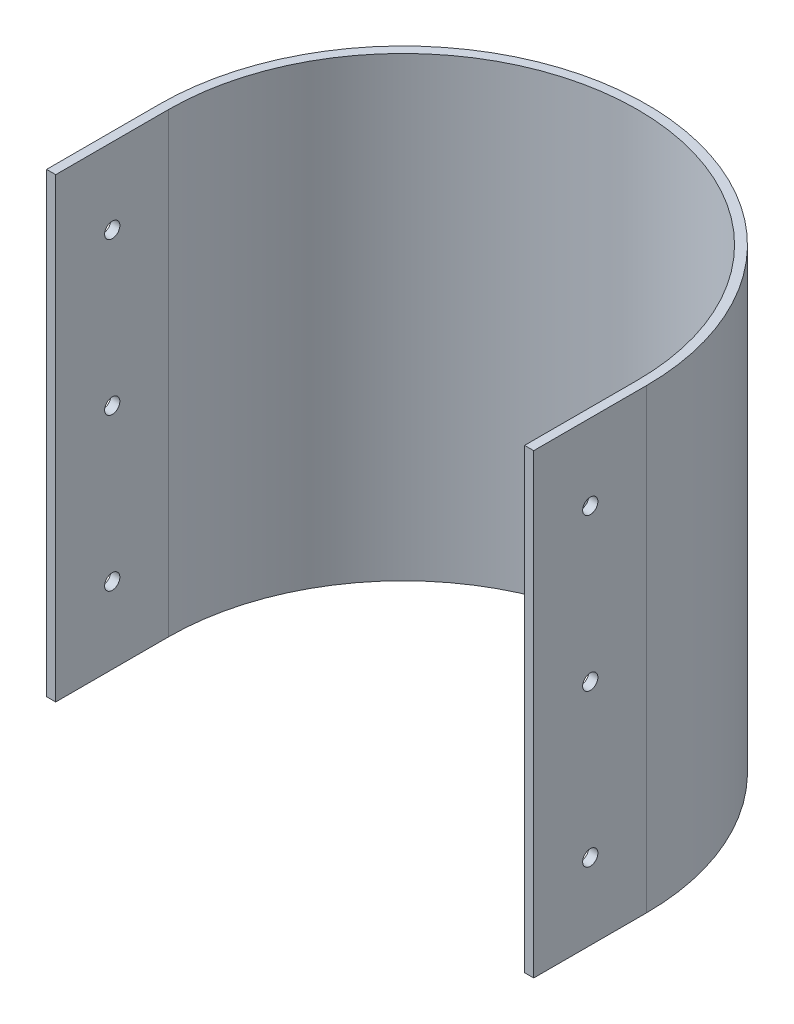
ISO-10303-21;
HEADER;
FILE_DESCRIPTION(('STEP AP214'),'2;1');
FILE_NAME('part.step','',(''),(''),'','','');
FILE_SCHEMA(('AUTOMOTIVE_DESIGN { 1 0 10303 214 1 1 1 1 }'));
ENDSEC;
DATA;
#1=APPLICATION_CONTEXT('core data for automotive mechanical design processes');
#2=APPLICATION_PROTOCOL_DEFINITION('international standard','automotive_design',2000,#1);
#3=PRODUCT_CONTEXT('',#1,'mechanical');
#4=PRODUCT('Part','Part','',(#3));
#5=PRODUCT_RELATED_PRODUCT_CATEGORY('part','',(#4));
#6=PRODUCT_DEFINITION_FORMATION('','',#4);
#7=PRODUCT_DEFINITION_CONTEXT('part definition',#1,'design');
#8=PRODUCT_DEFINITION('design','',#6,#7);
#9=PRODUCT_DEFINITION_SHAPE('','',#8);
#10=(LENGTH_UNIT() NAMED_UNIT(*) SI_UNIT(.MILLI.,.METRE.));
#11=(NAMED_UNIT(*) PLANE_ANGLE_UNIT() SI_UNIT($,.RADIAN.));
#12=(NAMED_UNIT(*) SI_UNIT($,.STERADIAN.) SOLID_ANGLE_UNIT());
#13=UNCERTAINTY_MEASURE_WITH_UNIT(LENGTH_MEASURE(1.E-05),#10,'distance_accuracy_value','');
#14=(GEOMETRIC_REPRESENTATION_CONTEXT(3) GLOBAL_UNCERTAINTY_ASSIGNED_CONTEXT((#13)) GLOBAL_UNIT_ASSIGNED_CONTEXT((#10,
#11,#12)) REPRESENTATION_CONTEXT('',''));
#15=CARTESIAN_POINT('',(0.,0.,0.));
#16=DIRECTION('',(0.,0.,1.));
#17=DIRECTION('',(1.,0.,0.));
#18=AXIS2_PLACEMENT_3D('',#15,#16,#17);
#19=CARTESIAN_POINT('',(-0.885057471264376,150.,0.));
#20=DIRECTION('',(0.,-1.,0.));
#21=DIRECTION('',(0.,0.,-1.));
#22=AXIS2_PLACEMENT_3D('',#19,#20,#21);
#23=CYLINDRICAL_SURFACE('',#22,77.);
#24=CARTESIAN_POINT('',(-0.885057471264376,0.,0.));
#25=DIRECTION('',(0.,-1.,0.));
#26=DIRECTION('',(0.,0.,-1.));
#27=AXIS2_PLACEMENT_3D('',#24,#25,#26);
#28=CIRCLE('',#27,77.);
#29=CARTESIAN_POINT('',(-77.8850574712644,0.,0.));
#30=VERTEX_POINT('',#29);
#31=CARTESIAN_POINT('',(76.1149425287356,0.,0.));
#32=VERTEX_POINT('',#31);
#33=EDGE_CURVE('E146',#30,#32,#28,.T.);
#34=ORIENTED_EDGE('',*,*,#33,.T.);
#35=DIRECTION('',(0.,-1.,0.));
#36=VECTOR('',#35,1.);
#37=CARTESIAN_POINT('',(76.1149425287356,150.,0.));
#38=LINE('',#37,#36);
#39=CARTESIAN_POINT('',(76.1149425287356,150.,0.));
#40=VERTEX_POINT('',#39);
#41=EDGE_CURVE('E11',#40,#32,#38,.T.);
#42=ORIENTED_EDGE('',*,*,#41,.F.);
#43=CARTESIAN_POINT('',(-0.885057471264376,150.,0.));
#44=DIRECTION('',(0.,-1.,0.));
#45=DIRECTION('',(0.,0.,-1.));
#46=AXIS2_PLACEMENT_3D('',#43,#44,#45);
#47=CIRCLE('',#46,77.);
#48=CARTESIAN_POINT('',(-77.8850574712644,150.,0.));
#49=VERTEX_POINT('',#48);
#50=EDGE_CURVE('E169',#49,#40,#47,.T.);
#51=ORIENTED_EDGE('',*,*,#50,.F.);
#52=DIRECTION('',(0.,-1.,0.));
#53=VECTOR('',#52,1.);
#54=CARTESIAN_POINT('',(-77.8850574712644,150.,0.));
#55=LINE('',#54,#53);
#56=EDGE_CURVE('E142',#49,#30,#55,.T.);
#57=ORIENTED_EDGE('',*,*,#56,.T.);
#58=EDGE_LOOP('',(#34,#42,#51,#57));
#59=FACE_BOUND('',#58,.T.);
#60=ADVANCED_FACE('F43',(#59),#23,.F.);
#61=CARTESIAN_POINT('',(76.1149425287356,150.,0.));
#62=DIRECTION('',(1.,0.,0.));
#63=DIRECTION('',(0.,0.,-1.));
#64=AXIS2_PLACEMENT_3D('',#61,#62,#63);
#65=PLANE('',#64);
#66=CARTESIAN_POINT('',(76.1149425287356,125.,18.5));
#67=DIRECTION('',(1.,0.,0.));
#68=DIRECTION('',(0.,0.,-1.));
#69=AXIS2_PLACEMENT_3D('',#66,#67,#68);
#70=CIRCLE('',#69,2.5);
#71=CARTESIAN_POINT('',(76.1149425287356,125.,16.));
#72=VERTEX_POINT('',#71);
#73=EDGE_CURVE('E151',#72,#72,#70,.T.);
#74=ORIENTED_EDGE('',*,*,#73,.T.);
#75=EDGE_LOOP('',(#74));
#76=FACE_BOUND('',#75,.T.);
#77=CARTESIAN_POINT('',(76.1149425287356,75.,18.5));
#78=DIRECTION('',(1.,0.,0.));
#79=DIRECTION('',(0.,0.,-1.));
#80=AXIS2_PLACEMENT_3D('',#77,#78,#79);
#81=CIRCLE('',#80,2.5);
#82=CARTESIAN_POINT('',(76.1149425287356,75.,16.));
#83=VERTEX_POINT('',#82);
#84=EDGE_CURVE('E195',#83,#83,#81,.T.);
#85=ORIENTED_EDGE('',*,*,#84,.T.);
#86=EDGE_LOOP('',(#85));
#87=FACE_BOUND('',#86,.T.);
#88=CARTESIAN_POINT('',(76.1149425287356,25.,18.5));
#89=DIRECTION('',(1.,0.,0.));
#90=DIRECTION('',(0.,0.,-1.));
#91=AXIS2_PLACEMENT_3D('',#88,#89,#90);
#92=CIRCLE('',#91,2.5);
#93=CARTESIAN_POINT('',(76.1149425287356,25.,16.));
#94=VERTEX_POINT('',#93);
#95=EDGE_CURVE('E190',#94,#94,#92,.T.);
#96=ORIENTED_EDGE('',*,*,#95,.T.);
#97=EDGE_LOOP('',(#96));
#98=FACE_BOUND('',#97,.T.);
#99=DIRECTION('',(0.,0.,1.));
#100=VECTOR('',#99,1.);
#101=CARTESIAN_POINT('',(76.1149425287356,0.,0.));
#102=LINE('',#101,#100);
#103=CARTESIAN_POINT('',(76.1149425287356,0.,37.0673767723387));
#104=VERTEX_POINT('',#103);
#105=EDGE_CURVE('E150',#32,#104,#102,.T.);
#106=ORIENTED_EDGE('',*,*,#105,.T.);
#107=DIRECTION('',(0.,-1.,0.));
#108=VECTOR('',#107,1.);
#109=CARTESIAN_POINT('',(76.1149425287356,150.,37.0673767723387));
#110=LINE('',#109,#108);
#111=CARTESIAN_POINT('',(76.1149425287356,150.,37.0673767723387));
#112=VERTEX_POINT('',#111);
#113=EDGE_CURVE('E53',#112,#104,#110,.T.);
#114=ORIENTED_EDGE('',*,*,#113,.F.);
#115=DIRECTION('',(0.,0.,1.));
#116=VECTOR('',#115,1.);
#117=CARTESIAN_POINT('',(76.1149425287356,150.,0.));
#118=LINE('',#117,#116);
#119=EDGE_CURVE('E105',#40,#112,#118,.T.);
#120=ORIENTED_EDGE('',*,*,#119,.F.);
#121=ORIENTED_EDGE('',*,*,#41,.T.);
#122=EDGE_LOOP('',(#106,#114,#120,#121));
#123=FACE_BOUND('',#122,.T.);
#124=ADVANCED_FACE('F250',(#76,#87,#98,#123),#65,.F.);
#125=CARTESIAN_POINT('',(76.1149425287356,150.,37.0673767723387));
#126=DIRECTION('',(0.,0.,-1.));
#127=DIRECTION('',(-1.,0.,0.));
#128=AXIS2_PLACEMENT_3D('',#125,#126,#127);
#129=PLANE('',#128);
#130=DIRECTION('',(1.,0.,0.));
#131=VECTOR('',#130,1.);
#132=CARTESIAN_POINT('',(76.1149425287356,0.,37.0673767723387));
#133=LINE('',#132,#131);
#134=CARTESIAN_POINT('',(79.1149425287356,0.,37.0673767723387));
#135=VERTEX_POINT('',#134);
#136=EDGE_CURVE('E154',#104,#135,#133,.T.);
#137=ORIENTED_EDGE('',*,*,#136,.T.);
#138=DIRECTION('',(0.,-1.,0.));
#139=VECTOR('',#138,1.);
#140=CARTESIAN_POINT('',(79.1149425287356,150.,37.0673767723387));
#141=LINE('',#140,#139);
#142=CARTESIAN_POINT('',(79.1149425287356,150.,37.0673767723387));
#143=VERTEX_POINT('',#142);
#144=EDGE_CURVE('E180',#143,#135,#141,.T.);
#145=ORIENTED_EDGE('',*,*,#144,.F.);
#146=DIRECTION('',(1.,0.,0.));
#147=VECTOR('',#146,1.);
#148=CARTESIAN_POINT('',(76.1149425287356,150.,37.0673767723387));
#149=LINE('',#148,#147);
#150=EDGE_CURVE('E217',#112,#143,#149,.T.);
#151=ORIENTED_EDGE('',*,*,#150,.F.);
#152=ORIENTED_EDGE('',*,*,#113,.T.);
#153=EDGE_LOOP('',(#137,#145,#151,#152));
#154=FACE_BOUND('',#153,.T.);
#155=ADVANCED_FACE('F255',(#154),#129,.F.);
#156=CARTESIAN_POINT('',(79.1149425287356,150.,37.0673767723387));
#157=DIRECTION('',(-1.,0.,0.));
#158=DIRECTION('',(0.,0.,1.));
#159=AXIS2_PLACEMENT_3D('',#156,#157,#158);
#160=PLANE('',#159);
#161=CARTESIAN_POINT('',(79.1149425287356,125.,18.5));
#162=DIRECTION('',(1.,0.,0.));
#163=DIRECTION('',(0.,0.,-1.));
#164=AXIS2_PLACEMENT_3D('',#161,#162,#163);
#165=CIRCLE('',#164,2.5);
#166=CARTESIAN_POINT('',(79.1149425287356,125.,16.));
#167=VERTEX_POINT('',#166);
#168=EDGE_CURVE('E428',#167,#167,#165,.T.);
#169=ORIENTED_EDGE('',*,*,#168,.F.);
#170=EDGE_LOOP('',(#169));
#171=FACE_BOUND('',#170,.T.);
#172=CARTESIAN_POINT('',(79.1149425287356,75.,18.5));
#173=DIRECTION('',(1.,0.,0.));
#174=DIRECTION('',(0.,0.,-1.));
#175=AXIS2_PLACEMENT_3D('',#172,#173,#174);
#176=CIRCLE('',#175,2.5);
#177=CARTESIAN_POINT('',(79.1149425287356,75.,16.));
#178=VERTEX_POINT('',#177);
#179=EDGE_CURVE('E423',#178,#178,#176,.T.);
#180=ORIENTED_EDGE('',*,*,#179,.F.);
#181=EDGE_LOOP('',(#180));
#182=FACE_BOUND('',#181,.T.);
#183=CARTESIAN_POINT('',(79.1149425287356,25.,18.5));
#184=DIRECTION('',(1.,0.,0.));
#185=DIRECTION('',(0.,0.,-1.));
#186=AXIS2_PLACEMENT_3D('',#183,#184,#185);
#187=CIRCLE('',#186,2.5);
#188=CARTESIAN_POINT('',(79.1149425287356,25.,16.));
#189=VERTEX_POINT('',#188);
#190=EDGE_CURVE('E436',#189,#189,#187,.T.);
#191=ORIENTED_EDGE('',*,*,#190,.F.);
#192=EDGE_LOOP('',(#191));
#193=FACE_BOUND('',#192,.T.);
#194=DIRECTION('',(0.,0.,-1.));
#195=VECTOR('',#194,1.);
#196=CARTESIAN_POINT('',(79.1149425287356,0.,37.0673767723387));
#197=LINE('',#196,#195);
#198=CARTESIAN_POINT('',(79.1149425287356,0.,0.));
#199=VERTEX_POINT('',#198);
#200=EDGE_CURVE('E157',#135,#199,#197,.T.);
#201=ORIENTED_EDGE('',*,*,#200,.T.);
#202=DIRECTION('',(0.,-1.,0.));
#203=VECTOR('',#202,1.);
#204=CARTESIAN_POINT('',(79.1149425287356,150.,0.));
#205=LINE('',#204,#203);
#206=CARTESIAN_POINT('',(79.1149425287356,150.,0.));
#207=VERTEX_POINT('',#206);
#208=EDGE_CURVE('E176',#207,#199,#205,.T.);
#209=ORIENTED_EDGE('',*,*,#208,.F.);
#210=DIRECTION('',(0.,0.,-1.));
#211=VECTOR('',#210,1.);
#212=CARTESIAN_POINT('',(79.1149425287356,150.,37.0673767723387));
#213=LINE('',#212,#211);
#214=EDGE_CURVE('E220',#143,#207,#213,.T.);
#215=ORIENTED_EDGE('',*,*,#214,.F.);
#216=ORIENTED_EDGE('',*,*,#144,.T.);
#217=EDGE_LOOP('',(#201,#209,#215,#216));
#218=FACE_BOUND('',#217,.T.);
#219=ADVANCED_FACE('F270',(#171,#182,#193,#218),#160,.F.);
#220=CARTESIAN_POINT('',(-0.885057471264362,150.,0.));
#221=DIRECTION('',(0.,-1.,0.));
#222=DIRECTION('',(0.,0.,-1.));
#223=AXIS2_PLACEMENT_3D('',#220,#221,#222);
#224=CYLINDRICAL_SURFACE('',#223,80.);
#225=CARTESIAN_POINT('',(-0.885057471264362,0.,0.));
#226=DIRECTION('',(0.,1.,0.));
#227=DIRECTION('',(0.,0.,-1.));
#228=AXIS2_PLACEMENT_3D('',#225,#226,#227);
#229=CIRCLE('',#228,80.);
#230=CARTESIAN_POINT('',(-80.8850574712644,0.,0.));
#231=VERTEX_POINT('',#230);
#232=EDGE_CURVE('E160',#199,#231,#229,.T.);
#233=ORIENTED_EDGE('',*,*,#232,.T.);
#234=DIRECTION('',(0.,-1.,0.));
#235=VECTOR('',#234,1.);
#236=CARTESIAN_POINT('',(-80.8850574712644,150.,0.));
#237=LINE('',#236,#235);
#238=CARTESIAN_POINT('',(-80.8850574712644,150.,0.));
#239=VERTEX_POINT('',#238);
#240=EDGE_CURVE('E135',#239,#231,#237,.T.);
#241=ORIENTED_EDGE('',*,*,#240,.F.);
#242=CARTESIAN_POINT('',(-0.885057471264362,150.,0.));
#243=DIRECTION('',(0.,1.,0.));
#244=DIRECTION('',(0.,0.,-1.));
#245=AXIS2_PLACEMENT_3D('',#242,#243,#244);
#246=CIRCLE('',#245,80.);
#247=EDGE_CURVE('E124',#207,#239,#246,.T.);
#248=ORIENTED_EDGE('',*,*,#247,.F.);
#249=ORIENTED_EDGE('',*,*,#208,.T.);
#250=EDGE_LOOP('',(#233,#241,#248,#249));
#251=FACE_BOUND('',#250,.T.);
#252=ADVANCED_FACE('F273',(#251),#224,.T.);
#253=CARTESIAN_POINT('',(-80.8850574712644,150.,0.));
#254=DIRECTION('',(1.,0.,0.));
#255=DIRECTION('',(0.,0.,-1.));
#256=AXIS2_PLACEMENT_3D('',#253,#254,#255);
#257=PLANE('',#256);
#258=CARTESIAN_POINT('',(-80.8850574712644,125.,18.5));
#259=DIRECTION('',(1.,0.,0.));
#260=DIRECTION('',(0.,0.,-1.));
#261=AXIS2_PLACEMENT_3D('',#258,#259,#260);
#262=CIRCLE('',#261,2.5);
#263=CARTESIAN_POINT('',(-80.8850574712644,125.,16.));
#264=VERTEX_POINT('',#263);
#265=EDGE_CURVE('E191',#264,#264,#262,.T.);
#266=ORIENTED_EDGE('',*,*,#265,.T.);
#267=EDGE_LOOP('',(#266));
#268=FACE_BOUND('',#267,.T.);
#269=CARTESIAN_POINT('',(-80.8850574712644,75.,18.5));
#270=DIRECTION('',(1.,0.,0.));
#271=DIRECTION('',(0.,0.,-1.));
#272=AXIS2_PLACEMENT_3D('',#269,#270,#271);
#273=CIRCLE('',#272,2.5);
#274=CARTESIAN_POINT('',(-80.8850574712644,75.,16.));
#275=VERTEX_POINT('',#274);
#276=EDGE_CURVE('E429',#275,#275,#273,.T.);
#277=ORIENTED_EDGE('',*,*,#276,.T.);
#278=EDGE_LOOP('',(#277));
#279=FACE_BOUND('',#278,.T.);
#280=CARTESIAN_POINT('',(-80.8850574712644,25.,18.5));
#281=DIRECTION('',(1.,0.,0.));
#282=DIRECTION('',(0.,0.,-1.));
#283=AXIS2_PLACEMENT_3D('',#280,#281,#282);
#284=CIRCLE('',#283,2.5);
#285=CARTESIAN_POINT('',(-80.8850574712644,25.,16.));
#286=VERTEX_POINT('',#285);
#287=EDGE_CURVE('E207',#286,#286,#284,.T.);
#288=ORIENTED_EDGE('',*,*,#287,.T.);
#289=EDGE_LOOP('',(#288));
#290=FACE_BOUND('',#289,.T.);
#291=DIRECTION('',(0.,0.,1.));
#292=VECTOR('',#291,1.);
#293=CARTESIAN_POINT('',(-80.8850574712644,0.,0.));
#294=LINE('',#293,#292);
#295=CARTESIAN_POINT('',(-80.8850574712644,0.,37.0673767723387));
#296=VERTEX_POINT('',#295);
#297=EDGE_CURVE('E133',#231,#296,#294,.T.);
#298=ORIENTED_EDGE('',*,*,#297,.T.);
#299=DIRECTION('',(0.,-1.,0.));
#300=VECTOR('',#299,1.);
#301=CARTESIAN_POINT('',(-80.8850574712644,150.,37.0673767723387));
#302=LINE('',#301,#300);
#303=CARTESIAN_POINT('',(-80.8850574712644,150.,37.0673767723387));
#304=VERTEX_POINT('',#303);
#305=EDGE_CURVE('E130',#304,#296,#302,.T.);
#306=ORIENTED_EDGE('',*,*,#305,.F.);
#307=DIRECTION('',(0.,0.,1.));
#308=VECTOR('',#307,1.);
#309=CARTESIAN_POINT('',(-80.8850574712644,150.,0.));
#310=LINE('',#309,#308);
#311=EDGE_CURVE('E118',#239,#304,#310,.T.);
#312=ORIENTED_EDGE('',*,*,#311,.F.);
#313=ORIENTED_EDGE('',*,*,#240,.T.);
#314=EDGE_LOOP('',(#298,#306,#312,#313));
#315=FACE_BOUND('',#314,.T.);
#316=ADVANCED_FACE('F131',(#268,#279,#290,#315),#257,.F.);
#317=CARTESIAN_POINT('',(-80.8850574712644,150.,37.0673767723387));
#318=DIRECTION('',(0.,0.,-1.));
#319=DIRECTION('',(-1.,0.,0.));
#320=AXIS2_PLACEMENT_3D('',#317,#318,#319);
#321=PLANE('',#320);
#322=DIRECTION('',(1.,0.,0.));
#323=VECTOR('',#322,1.);
#324=CARTESIAN_POINT('',(-80.8850574712644,0.,37.0673767723387));
#325=LINE('',#324,#323);
#326=CARTESIAN_POINT('',(-77.8850574712644,0.,37.0673767723387));
#327=VERTEX_POINT('',#326);
#328=EDGE_CURVE('E91',#296,#327,#325,.T.);
#329=ORIENTED_EDGE('',*,*,#328,.T.);
#330=DIRECTION('',(0.,-1.,0.));
#331=VECTOR('',#330,1.);
#332=CARTESIAN_POINT('',(-77.8850574712644,150.,37.0673767723387));
#333=LINE('',#332,#331);
#334=CARTESIAN_POINT('',(-77.8850574712644,150.,37.0673767723387));
#335=VERTEX_POINT('',#334);
#336=EDGE_CURVE('E136',#335,#327,#333,.T.);
#337=ORIENTED_EDGE('',*,*,#336,.F.);
#338=DIRECTION('',(1.,0.,0.));
#339=VECTOR('',#338,1.);
#340=CARTESIAN_POINT('',(-80.8850574712644,150.,37.0673767723387));
#341=LINE('',#340,#339);
#342=EDGE_CURVE('E122',#304,#335,#341,.T.);
#343=ORIENTED_EDGE('',*,*,#342,.F.);
#344=ORIENTED_EDGE('',*,*,#305,.T.);
#345=EDGE_LOOP('',(#329,#337,#343,#344));
#346=FACE_BOUND('',#345,.T.);
#347=ADVANCED_FACE('F138',(#346),#321,.F.);
#348=CARTESIAN_POINT('',(-77.8850574712644,150.,37.0673767723387));
#349=DIRECTION('',(-1.,0.,0.));
#350=DIRECTION('',(0.,0.,1.));
#351=AXIS2_PLACEMENT_3D('',#348,#349,#350);
#352=PLANE('',#351);
#353=CARTESIAN_POINT('',(-77.8850574712644,125.,18.5));
#354=DIRECTION('',(-1.,0.,0.));
#355=DIRECTION('',(0.,0.,1.));
#356=AXIS2_PLACEMENT_3D('',#353,#354,#355);
#357=CIRCLE('',#356,2.5);
#358=CARTESIAN_POINT('',(-77.8850574712644,125.,21.));
#359=VERTEX_POINT('',#358);
#360=EDGE_CURVE('E46',#359,#359,#357,.T.);
#361=ORIENTED_EDGE('',*,*,#360,.T.);
#362=EDGE_LOOP('',(#361));
#363=FACE_BOUND('',#362,.T.);
#364=CARTESIAN_POINT('',(-77.8850574712644,75.,18.5));
#365=DIRECTION('',(-1.,0.,0.));
#366=DIRECTION('',(0.,0.,1.));
#367=AXIS2_PLACEMENT_3D('',#364,#365,#366);
#368=CIRCLE('',#367,2.5);
#369=CARTESIAN_POINT('',(-77.8850574712644,75.,21.));
#370=VERTEX_POINT('',#369);
#371=EDGE_CURVE('E192',#370,#370,#368,.T.);
#372=ORIENTED_EDGE('',*,*,#371,.T.);
#373=EDGE_LOOP('',(#372));
#374=FACE_BOUND('',#373,.T.);
#375=CARTESIAN_POINT('',(-77.8850574712644,25.,18.5));
#376=DIRECTION('',(-1.,0.,0.));
#377=DIRECTION('',(0.,0.,1.));
#378=AXIS2_PLACEMENT_3D('',#375,#376,#377);
#379=CIRCLE('',#378,2.5);
#380=CARTESIAN_POINT('',(-77.8850574712644,25.,21.));
#381=VERTEX_POINT('',#380);
#382=EDGE_CURVE('E187',#381,#381,#379,.T.);
#383=ORIENTED_EDGE('',*,*,#382,.T.);
#384=EDGE_LOOP('',(#383));
#385=FACE_BOUND('',#384,.T.);
#386=DIRECTION('',(0.,0.,-1.));
#387=VECTOR('',#386,1.);
#388=CARTESIAN_POINT('',(-77.8850574712644,0.,37.0673767723387));
#389=LINE('',#388,#387);
#390=EDGE_CURVE('E97',#327,#30,#389,.T.);
#391=ORIENTED_EDGE('',*,*,#390,.T.);
#392=ORIENTED_EDGE('',*,*,#56,.F.);
#393=DIRECTION('',(0.,0.,-1.));
#394=VECTOR('',#393,1.);
#395=CARTESIAN_POINT('',(-77.8850574712644,150.,37.0673767723387));
#396=LINE('',#395,#394);
#397=EDGE_CURVE('E62',#335,#49,#396,.T.);
#398=ORIENTED_EDGE('',*,*,#397,.F.);
#399=ORIENTED_EDGE('',*,*,#336,.T.);
#400=EDGE_LOOP('',(#391,#392,#398,#399));
#401=FACE_BOUND('',#400,.T.);
#402=ADVANCED_FACE('F227',(#363,#374,#385,#401),#352,.F.);
#403=CARTESIAN_POINT('',(-0.885057471264376,150.,0.));
#404=DIRECTION('',(0.,-1.,0.));
#405=DIRECTION('',(0.,0.,-1.));
#406=AXIS2_PLACEMENT_3D('',#403,#404,#405);
#407=PLANE('',#406);
#408=ORIENTED_EDGE('',*,*,#50,.T.);
#409=ORIENTED_EDGE('',*,*,#119,.T.);
#410=ORIENTED_EDGE('',*,*,#150,.T.);
#411=ORIENTED_EDGE('',*,*,#214,.T.);
#412=ORIENTED_EDGE('',*,*,#247,.T.);
#413=ORIENTED_EDGE('',*,*,#311,.T.);
#414=ORIENTED_EDGE('',*,*,#342,.T.);
#415=ORIENTED_EDGE('',*,*,#397,.T.);
#416=EDGE_LOOP('',(#408,#409,#410,#411,#412,#413,#414,#415));
#417=FACE_BOUND('',#416,.T.);
#418=ADVANCED_FACE('F120',(#417),#407,.F.);
#419=CARTESIAN_POINT('',(-0.885057471264376,0.,0.));
#420=DIRECTION('',(0.,-1.,0.));
#421=DIRECTION('',(0.,0.,-1.));
#422=AXIS2_PLACEMENT_3D('',#419,#420,#421);
#423=PLANE('',#422);
#424=ORIENTED_EDGE('',*,*,#33,.F.);
#425=ORIENTED_EDGE('',*,*,#390,.F.);
#426=ORIENTED_EDGE('',*,*,#328,.F.);
#427=ORIENTED_EDGE('',*,*,#297,.F.);
#428=ORIENTED_EDGE('',*,*,#232,.F.);
#429=ORIENTED_EDGE('',*,*,#200,.F.);
#430=ORIENTED_EDGE('',*,*,#136,.F.);
#431=ORIENTED_EDGE('',*,*,#105,.F.);
#432=EDGE_LOOP('',(#424,#425,#426,#427,#428,#429,#430,#431));
#433=FACE_BOUND('',#432,.T.);
#434=ADVANCED_FACE('F261',(#433),#423,.T.);
#435=CARTESIAN_POINT('',(-80.8850574712644,25.,18.5));
#436=DIRECTION('',(1.,0.,0.));
#437=DIRECTION('',(0.,0.,-1.));
#438=AXIS2_PLACEMENT_3D('',#435,#436,#437);
#439=CYLINDRICAL_SURFACE('',#438,2.5);
#440=ORIENTED_EDGE('',*,*,#287,.F.);
#441=EDGE_LOOP('',(#440));
#442=FACE_BOUND('',#441,.T.);
#443=ORIENTED_EDGE('',*,*,#382,.F.);
#444=EDGE_LOOP('',(#443));
#445=FACE_BOUND('',#444,.T.);
#446=ADVANCED_FACE('F243',(#442,#445),#439,.F.);
#447=CARTESIAN_POINT('',(-80.8850574712644,75.,18.5));
#448=DIRECTION('',(1.,0.,0.));
#449=DIRECTION('',(0.,0.,-1.));
#450=AXIS2_PLACEMENT_3D('',#447,#448,#449);
#451=CYLINDRICAL_SURFACE('',#450,2.5);
#452=ORIENTED_EDGE('',*,*,#276,.F.);
#453=EDGE_LOOP('',(#452));
#454=FACE_BOUND('',#453,.T.);
#455=ORIENTED_EDGE('',*,*,#371,.F.);
#456=EDGE_LOOP('',(#455));
#457=FACE_BOUND('',#456,.T.);
#458=ADVANCED_FACE('F232',(#454,#457),#451,.F.);
#459=CARTESIAN_POINT('',(-80.8850574712644,125.,18.5));
#460=DIRECTION('',(1.,0.,0.));
#461=DIRECTION('',(0.,0.,-1.));
#462=AXIS2_PLACEMENT_3D('',#459,#460,#461);
#463=CYLINDRICAL_SURFACE('',#462,2.5);
#464=ORIENTED_EDGE('',*,*,#265,.F.);
#465=EDGE_LOOP('',(#464));
#466=FACE_BOUND('',#465,.T.);
#467=ORIENTED_EDGE('',*,*,#360,.F.);
#468=EDGE_LOOP('',(#467));
#469=FACE_BOUND('',#468,.T.);
#470=ADVANCED_FACE('F229',(#466,#469),#463,.F.);
#471=ORIENTED_EDGE('',*,*,#190,.T.);
#472=EDGE_LOOP('',(#471));
#473=FACE_BOUND('',#472,.T.);
#474=ORIENTED_EDGE('',*,*,#95,.F.);
#475=EDGE_LOOP('',(#474));
#476=FACE_BOUND('',#475,.T.);
#477=ADVANCED_FACE('F231',(#473,#476),#439,.F.);
#478=ORIENTED_EDGE('',*,*,#179,.T.);
#479=EDGE_LOOP('',(#478));
#480=FACE_BOUND('',#479,.T.);
#481=ORIENTED_EDGE('',*,*,#84,.F.);
#482=EDGE_LOOP('',(#481));
#483=FACE_BOUND('',#482,.T.);
#484=ADVANCED_FACE('F240',(#480,#483),#451,.F.);
#485=ORIENTED_EDGE('',*,*,#168,.T.);
#486=EDGE_LOOP('',(#485));
#487=FACE_BOUND('',#486,.T.);
#488=ORIENTED_EDGE('',*,*,#73,.F.);
#489=EDGE_LOOP('',(#488));
#490=FACE_BOUND('',#489,.T.);
#491=ADVANCED_FACE('F235',(#487,#490),#463,.F.);
#492=CLOSED_SHELL('',(#60,#124,#155,#219,#252,#316,#347,#402,#418,#434,#446,#458,#470,#477,#484,#491));
#493=MANIFOLD_SOLID_BREP('B2',#492);
#494=ADVANCED_BREP_SHAPE_REPRESENTATION('',(#18,#493),#14);
#495=SHAPE_DEFINITION_REPRESENTATION(#9,#494);
ENDSEC;
END-ISO-10303-21;
